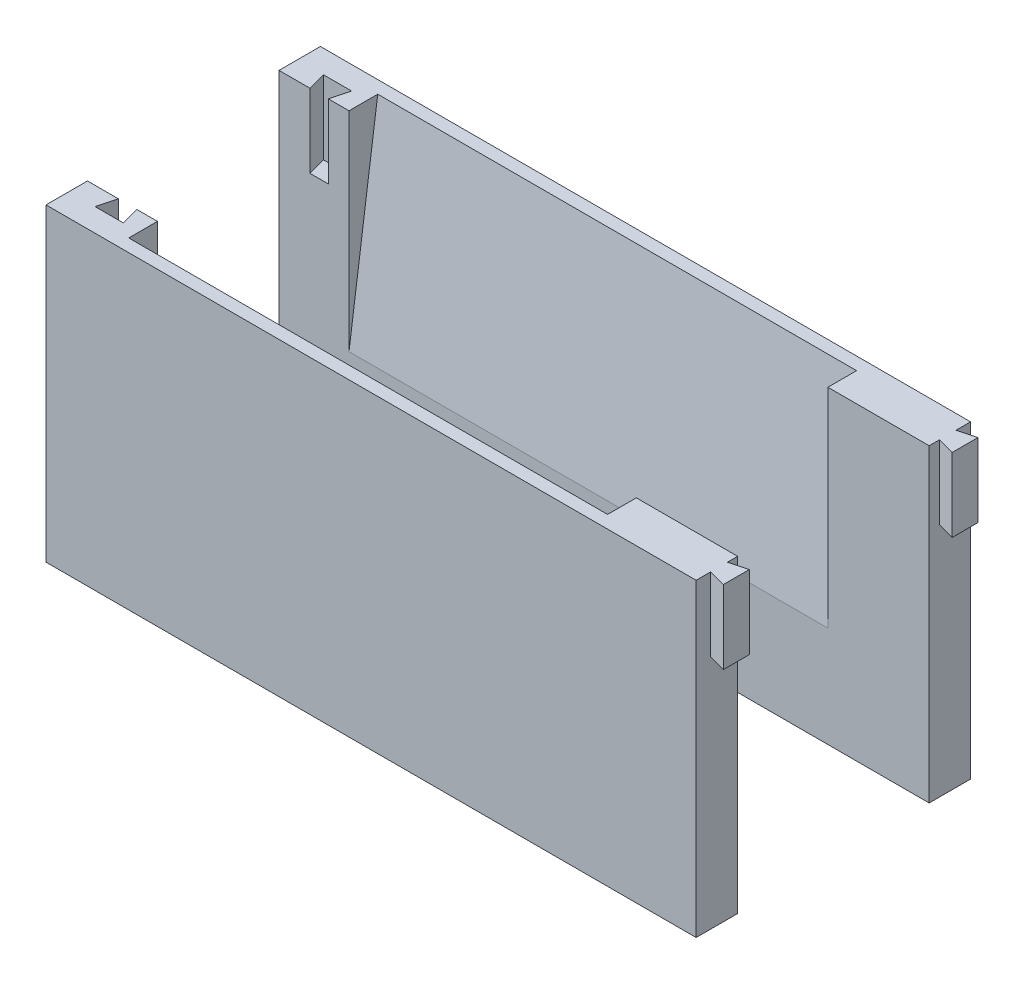
ISO-10303-21;
HEADER;
FILE_DESCRIPTION(('STEP AP214'),'2;1');
FILE_NAME('part.step','',(''),(''),'','','');
FILE_SCHEMA(('AUTOMOTIVE_DESIGN { 1 0 10303 214 1 1 1 1 }'));
ENDSEC;
DATA;
#1=APPLICATION_CONTEXT('core data for automotive mechanical design processes');
#2=APPLICATION_PROTOCOL_DEFINITION('international standard','automotive_design',2000,#1);
#3=PRODUCT_CONTEXT('',#1,'mechanical');
#4=PRODUCT('Part','Part','',(#3));
#5=PRODUCT_RELATED_PRODUCT_CATEGORY('part','',(#4));
#6=PRODUCT_DEFINITION_FORMATION('','',#4);
#7=PRODUCT_DEFINITION_CONTEXT('part definition',#1,'design');
#8=PRODUCT_DEFINITION('design','',#6,#7);
#9=PRODUCT_DEFINITION_SHAPE('','',#8);
#10=(LENGTH_UNIT() NAMED_UNIT(*) SI_UNIT(.MILLI.,.METRE.));
#11=(NAMED_UNIT(*) PLANE_ANGLE_UNIT() SI_UNIT($,.RADIAN.));
#12=(NAMED_UNIT(*) SI_UNIT($,.STERADIAN.) SOLID_ANGLE_UNIT());
#13=UNCERTAINTY_MEASURE_WITH_UNIT(LENGTH_MEASURE(1.E-05),#10,'distance_accuracy_value','');
#14=(GEOMETRIC_REPRESENTATION_CONTEXT(3) GLOBAL_UNCERTAINTY_ASSIGNED_CONTEXT((#13)) GLOBAL_UNIT_ASSIGNED_CONTEXT((#10,
#11,#12)) REPRESENTATION_CONTEXT('',''));
#15=CARTESIAN_POINT('',(0.,0.,0.));
#16=DIRECTION('',(0.,0.,1.));
#17=DIRECTION('',(1.,0.,0.));
#18=AXIS2_PLACEMENT_3D('',#15,#16,#17);
#19=CARTESIAN_POINT('',(46.2989745050857,14.0482922625164,-31.));
#20=DIRECTION('',(-1.,0.,0.));
#21=DIRECTION('',(0.,0.,-1.));
#22=AXIS2_PLACEMENT_3D('',#19,#20,#21);
#23=PLANE('',#22);
#24=DIRECTION('',(0.,1.,0.));
#25=VECTOR('',#24,1.);
#26=CARTESIAN_POINT('',(46.2989745050857,4.04829226251643,-27.4));
#27=LINE('',#26,#25);
#28=CARTESIAN_POINT('',(46.2989745050857,4.04829226251643,-27.4));
#29=VERTEX_POINT('',#28);
#30=CARTESIAN_POINT('',(46.2989745050857,14.0482922625164,-27.4));
#31=VERTEX_POINT('',#30);
#32=EDGE_CURVE('E227',#29,#31,#27,.T.);
#33=ORIENTED_EDGE('',*,*,#32,.T.);
#34=DIRECTION('',(0.,0.,1.));
#35=VECTOR('',#34,1.);
#36=CARTESIAN_POINT('',(46.2989745050857,14.0482922625164,-31.));
#37=LINE('',#36,#35);
#38=CARTESIAN_POINT('',(46.2989745050857,14.0482922625164,-26.));
#39=VERTEX_POINT('',#38);
#40=EDGE_CURVE('E172',#31,#39,#37,.T.);
#41=ORIENTED_EDGE('',*,*,#40,.T.);
#42=DIRECTION('',(0.,1.,0.));
#43=VECTOR('',#42,1.);
#44=CARTESIAN_POINT('',(46.2989745050857,14.0482922625164,-26.));
#45=LINE('',#44,#43);
#46=CARTESIAN_POINT('',(46.2989745050857,-27.9517077374836,-26.));
#47=VERTEX_POINT('',#46);
#48=EDGE_CURVE('E269',#47,#39,#45,.T.);
#49=ORIENTED_EDGE('',*,*,#48,.F.);
#50=DIRECTION('',(0.,0.,1.));
#51=VECTOR('',#50,1.);
#52=CARTESIAN_POINT('',(46.2989745050857,-27.9517077374836,-31.));
#53=LINE('',#52,#51);
#54=CARTESIAN_POINT('',(46.2989745050857,-27.9517077374836,-31.6203193977869));
#55=VERTEX_POINT('',#54);
#56=EDGE_CURVE('E63',#55,#47,#53,.T.);
#57=ORIENTED_EDGE('',*,*,#56,.F.);
#58=DIRECTION('',(0.,1.,0.));
#59=VECTOR('',#58,1.);
#60=CARTESIAN_POINT('',(46.2989745050857,-27.9517077374836,-31.6203193977869));
#61=LINE('',#60,#59);
#62=CARTESIAN_POINT('',(46.2989745050857,14.0482922625164,-31.6203193977869));
#63=VERTEX_POINT('',#62);
#64=EDGE_CURVE('E182',#55,#63,#61,.T.);
#65=ORIENTED_EDGE('',*,*,#64,.T.);
#66=CARTESIAN_POINT('',(46.2989745050857,14.0482922625164,-29.65));
#67=VERTEX_POINT('',#66);
#68=EDGE_CURVE('E186',#63,#67,#37,.T.);
#69=ORIENTED_EDGE('',*,*,#68,.T.);
#70=DIRECTION('',(0.,1.,0.));
#71=VECTOR('',#70,1.);
#72=CARTESIAN_POINT('',(46.2989745050857,4.04829226251643,-29.65));
#73=LINE('',#72,#71);
#74=CARTESIAN_POINT('',(46.2989745050857,4.04829226251643,-29.65));
#75=VERTEX_POINT('',#74);
#76=EDGE_CURVE('E221',#75,#67,#73,.T.);
#77=ORIENTED_EDGE('',*,*,#76,.F.);
#78=DIRECTION('',(0.,0.,-1.));
#79=VECTOR('',#78,1.);
#80=CARTESIAN_POINT('',(46.2989745050857,4.04829226251643,-27.4));
#81=LINE('',#80,#79);
#82=EDGE_CURVE('E211',#29,#75,#81,.T.);
#83=ORIENTED_EDGE('',*,*,#82,.F.);
#84=EDGE_LOOP('',(#33,#41,#49,#57,#65,#69,#77,#83));
#85=FACE_BOUND('',#84,.T.);
#86=ADVANCED_FACE('F55',(#85),#23,.F.);
#87=CARTESIAN_POINT('',(0.,0.,-26.));
#88=DIRECTION('',(0.,0.,-1.));
#89=DIRECTION('',(1.,0.,0.));
#90=AXIS2_PLACEMENT_3D('',#87,#88,#89);
#91=PLANE('',#90);
#92=DIRECTION('',(1.,0.,0.));
#93=VECTOR('',#92,1.);
#94=CARTESIAN_POINT('',(0.,-14.2665496728761,-26.));
#95=LINE('',#94,#93);
#96=CARTESIAN_POINT('',(-32.4510254949143,-14.2665496728761,-26.));
#97=VERTEX_POINT('',#96);
#98=CARTESIAN_POINT('',(32.5489745050857,-14.2665496728761,-26.));
#99=VERTEX_POINT('',#98);
#100=EDGE_CURVE('E208',#97,#99,#95,.T.);
#101=ORIENTED_EDGE('',*,*,#100,.F.);
#102=DIRECTION('',(0.,1.,0.));
#103=VECTOR('',#102,1.);
#104=CARTESIAN_POINT('',(-32.4510254949143,0.,-26.));
#105=LINE('',#104,#103);
#106=CARTESIAN_POINT('',(-32.4510254949143,14.0482922625164,-26.));
#107=VERTEX_POINT('',#106);
#108=EDGE_CURVE('E202',#97,#107,#105,.T.);
#109=ORIENTED_EDGE('',*,*,#108,.T.);
#110=DIRECTION('',(-1.,0.,0.));
#111=VECTOR('',#110,1.);
#112=CARTESIAN_POINT('',(-41.9510254949143,14.0482922625164,-26.));
#113=LINE('',#112,#111);
#114=CARTESIAN_POINT('',(-35.2510254949143,14.0482922625164,-26.));
#115=VERTEX_POINT('',#114);
#116=EDGE_CURVE('E274',#107,#115,#113,.T.);
#117=ORIENTED_EDGE('',*,*,#116,.T.);
#118=DIRECTION('',(0.,-1.,0.));
#119=VECTOR('',#118,1.);
#120=CARTESIAN_POINT('',(-35.2510254949143,188.876376348919,-26.));
#121=LINE('',#120,#119);
#122=CARTESIAN_POINT('',(-35.2510254949143,4.04829226251643,-26.));
#123=VERTEX_POINT('',#122);
#124=EDGE_CURVE('E258',#115,#123,#121,.T.);
#125=ORIENTED_EDGE('',*,*,#124,.T.);
#126=DIRECTION('',(-1.,0.,0.));
#127=VECTOR('',#126,1.);
#128=CARTESIAN_POINT('',(-41.9510254949143,4.04829226251643,-26.));
#129=LINE('',#128,#127);
#130=CARTESIAN_POINT('',(-37.7510254949143,4.04829226251643,-26.));
#131=VERTEX_POINT('',#130);
#132=EDGE_CURVE('E230',#123,#131,#129,.T.);
#133=ORIENTED_EDGE('',*,*,#132,.T.);
#134=DIRECTION('',(0.,-1.,0.));
#135=VECTOR('',#134,1.);
#136=CARTESIAN_POINT('',(-37.7510254949143,188.876376348919,-26.));
#137=LINE('',#136,#135);
#138=CARTESIAN_POINT('',(-37.7510254949143,14.0482922625164,-26.));
#139=VERTEX_POINT('',#138);
#140=EDGE_CURVE('E239',#139,#131,#137,.T.);
#141=ORIENTED_EDGE('',*,*,#140,.F.);
#142=CARTESIAN_POINT('',(-41.9510254949143,14.0482922625164,-26.));
#143=VERTEX_POINT('',#142);
#144=EDGE_CURVE('E272',#139,#143,#113,.T.);
#145=ORIENTED_EDGE('',*,*,#144,.T.);
#146=DIRECTION('',(0.,-1.,0.));
#147=VECTOR('',#146,1.);
#148=CARTESIAN_POINT('',(-41.9510254949143,14.0482922625164,-26.));
#149=LINE('',#148,#147);
#150=CARTESIAN_POINT('',(-41.9510254949143,-27.9517077374836,-26.));
#151=VERTEX_POINT('',#150);
#152=EDGE_CURVE('E168',#143,#151,#149,.T.);
#153=ORIENTED_EDGE('',*,*,#152,.T.);
#154=DIRECTION('',(1.,0.,0.));
#155=VECTOR('',#154,1.);
#156=CARTESIAN_POINT('',(-41.9510254949143,-27.9517077374836,-26.));
#157=LINE('',#156,#155);
#158=EDGE_CURVE('E267',#151,#47,#157,.T.);
#159=ORIENTED_EDGE('',*,*,#158,.T.);
#160=ORIENTED_EDGE('',*,*,#48,.T.);
#161=CARTESIAN_POINT('',(32.5489745050857,14.0482922625164,-26.));
#162=VERTEX_POINT('',#161);
#163=EDGE_CURVE('E173',#39,#162,#113,.T.);
#164=ORIENTED_EDGE('',*,*,#163,.T.);
#165=DIRECTION('',(0.,1.,0.));
#166=VECTOR('',#165,1.);
#167=CARTESIAN_POINT('',(32.5489745050857,0.,-26.));
#168=LINE('',#167,#166);
#169=EDGE_CURVE('E205',#99,#162,#168,.T.);
#170=ORIENTED_EDGE('',*,*,#169,.F.);
#171=EDGE_LOOP('',(#101,#109,#117,#125,#133,#141,#145,#153,#159,#160,#164,#170));
#172=FACE_BOUND('',#171,.T.);
#173=ADVANCED_FACE('F286',(#172),#91,.F.);
#174=CARTESIAN_POINT('',(-41.9510254949143,14.0482922625164,-31.));
#175=DIRECTION('',(1.,0.,0.));
#176=DIRECTION('',(0.,0.,1.));
#177=AXIS2_PLACEMENT_3D('',#174,#175,#176);
#178=PLANE('',#177);
#179=ORIENTED_EDGE('',*,*,#152,.F.);
#180=DIRECTION('',(0.,0.,1.));
#181=VECTOR('',#180,1.);
#182=CARTESIAN_POINT('',(-41.9510254949143,14.0482922625164,-31.));
#183=LINE('',#182,#181);
#184=CARTESIAN_POINT('',(-41.9510254949143,14.0482922625164,-31.6203193977869));
#185=VERTEX_POINT('',#184);
#186=EDGE_CURVE('E163',#185,#143,#183,.T.);
#187=ORIENTED_EDGE('',*,*,#186,.F.);
#188=DIRECTION('',(0.,1.,0.));
#189=VECTOR('',#188,1.);
#190=CARTESIAN_POINT('',(-41.9510254949143,-27.9517077374836,-31.6203193977869));
#191=LINE('',#190,#189);
#192=CARTESIAN_POINT('',(-41.9510254949143,-27.9517077374836,-31.6203193977869));
#193=VERTEX_POINT('',#192);
#194=EDGE_CURVE('E165',#193,#185,#191,.T.);
#195=ORIENTED_EDGE('',*,*,#194,.F.);
#196=DIRECTION('',(0.,0.,1.));
#197=VECTOR('',#196,1.);
#198=CARTESIAN_POINT('',(-41.9510254949143,-27.9517077374836,-31.));
#199=LINE('',#198,#197);
#200=EDGE_CURVE('E12',#193,#151,#199,.T.);
#201=ORIENTED_EDGE('',*,*,#200,.T.);
#202=EDGE_LOOP('',(#179,#187,#195,#201));
#203=FACE_BOUND('',#202,.T.);
#204=ADVANCED_FACE('F57',(#203),#178,.F.);
#205=CARTESIAN_POINT('',(-41.9510254949143,-27.9517077374836,-31.));
#206=DIRECTION('',(0.,1.,0.));
#207=DIRECTION('',(0.,0.,-1.));
#208=AXIS2_PLACEMENT_3D('',#205,#206,#207);
#209=PLANE('',#208);
#210=ORIENTED_EDGE('',*,*,#158,.F.);
#211=ORIENTED_EDGE('',*,*,#200,.F.);
#212=DIRECTION('',(-1.,0.,0.));
#213=VECTOR('',#212,1.);
#214=CARTESIAN_POINT('',(-41.9510254949143,-27.9517077374836,-31.6203193977869));
#215=LINE('',#214,#213);
#216=EDGE_CURVE('E181',#55,#193,#215,.T.);
#217=ORIENTED_EDGE('',*,*,#216,.F.);
#218=ORIENTED_EDGE('',*,*,#56,.T.);
#219=EDGE_LOOP('',(#210,#211,#217,#218));
#220=FACE_BOUND('',#219,.T.);
#221=ADVANCED_FACE('F280',(#220),#209,.F.);
#222=CARTESIAN_POINT('',(-41.9510254949143,14.0482922625164,-31.));
#223=DIRECTION('',(0.,-1.,0.));
#224=DIRECTION('',(0.,0.,1.));
#225=AXIS2_PLACEMENT_3D('',#222,#223,#224);
#226=PLANE('',#225);
#227=ORIENTED_EDGE('',*,*,#163,.F.);
#228=ORIENTED_EDGE('',*,*,#40,.F.);
#229=DIRECTION('',(-0.965925826289067,0.,-0.258819045102525));
#230=VECTOR('',#229,1.);
#231=CARTESIAN_POINT('',(48.6489745050857,14.0482922625164,-26.7703193977868));
#232=LINE('',#231,#230);
#233=CARTESIAN_POINT('',(48.6489745050857,14.0482922625164,-26.7703193977868));
#234=VERTEX_POINT('',#233);
#235=EDGE_CURVE('E215',#234,#31,#232,.T.);
#236=ORIENTED_EDGE('',*,*,#235,.F.);
#237=DIRECTION('',(0.,0.,1.));
#238=VECTOR('',#237,1.);
#239=CARTESIAN_POINT('',(48.6489745050857,14.0482922625164,-30.2796806022131));
#240=LINE('',#239,#238);
#241=CARTESIAN_POINT('',(48.6489745050857,14.0482922625164,-30.2796806022131));
#242=VERTEX_POINT('',#241);
#243=EDGE_CURVE('E223',#242,#234,#240,.T.);
#244=ORIENTED_EDGE('',*,*,#243,.F.);
#245=DIRECTION('',(0.965925826289067,0.,-0.258819045102525));
#246=VECTOR('',#245,1.);
#247=CARTESIAN_POINT('',(46.2989745050857,14.0482922625164,-29.65));
#248=LINE('',#247,#246);
#249=EDGE_CURVE('E78',#67,#242,#248,.T.);
#250=ORIENTED_EDGE('',*,*,#249,.F.);
#251=ORIENTED_EDGE('',*,*,#68,.F.);
#252=DIRECTION('',(-1.,0.,0.));
#253=VECTOR('',#252,1.);
#254=CARTESIAN_POINT('',(-41.9510254949143,14.0482922625164,-31.6203193977869));
#255=LINE('',#254,#253);
#256=EDGE_CURVE('E179',#63,#185,#255,.T.);
#257=ORIENTED_EDGE('',*,*,#256,.T.);
#258=ORIENTED_EDGE('',*,*,#186,.T.);
#259=ORIENTED_EDGE('',*,*,#144,.F.);
#260=DIRECTION('',(0.258819045102517,0.,0.965925826289069));
#261=VECTOR('',#260,1.);
#262=CARTESIAN_POINT('',(-37.7510254949143,14.0482922625164,-26.));
#263=LINE('',#262,#261);
#264=CARTESIAN_POINT('',(-38.4208984759921,14.0482922625164,-28.5));
#265=VERTEX_POINT('',#264);
#266=EDGE_CURVE('E243',#265,#139,#263,.T.);
#267=ORIENTED_EDGE('',*,*,#266,.F.);
#268=DIRECTION('',(-1.,0.,0.));
#269=VECTOR('',#268,1.);
#270=CARTESIAN_POINT('',(-38.4208984759921,14.0482922625164,-28.5));
#271=LINE('',#270,#269);
#272=CARTESIAN_POINT('',(-34.5811525138365,14.0482922625164,-28.5));
#273=VERTEX_POINT('',#272);
#274=EDGE_CURVE('E249',#273,#265,#271,.T.);
#275=ORIENTED_EDGE('',*,*,#274,.F.);
#276=DIRECTION('',(0.258819045102517,0.,-0.965925826289069));
#277=VECTOR('',#276,1.);
#278=CARTESIAN_POINT('',(-34.5811525138365,14.0482922625164,-28.5));
#279=LINE('',#278,#277);
#280=EDGE_CURVE('E246',#115,#273,#279,.T.);
#281=ORIENTED_EDGE('',*,*,#280,.F.);
#282=ORIENTED_EDGE('',*,*,#116,.F.);
#283=DIRECTION('',(0.,0.,1.));
#284=VECTOR('',#283,1.);
#285=CARTESIAN_POINT('',(-32.4510254949143,14.0482922625164,-26.));
#286=LINE('',#285,#284);
#287=CARTESIAN_POINT('',(-32.4510254949143,14.0482922625164,-29.9));
#288=VERTEX_POINT('',#287);
#289=EDGE_CURVE('E70',#288,#107,#286,.T.);
#290=ORIENTED_EDGE('',*,*,#289,.F.);
#291=DIRECTION('',(-1.,0.,0.));
#292=VECTOR('',#291,1.);
#293=CARTESIAN_POINT('',(32.5489745050857,14.0482922625164,-29.9));
#294=LINE('',#293,#292);
#295=CARTESIAN_POINT('',(32.5489745050857,14.0482922625164,-29.9));
#296=VERTEX_POINT('',#295);
#297=EDGE_CURVE('E197',#296,#288,#294,.T.);
#298=ORIENTED_EDGE('',*,*,#297,.F.);
#299=DIRECTION('',(0.,0.,1.));
#300=VECTOR('',#299,1.);
#301=CARTESIAN_POINT('',(32.5489745050857,14.0482922625164,-26.));
#302=LINE('',#301,#300);
#303=EDGE_CURVE('E196',#296,#162,#302,.T.);
#304=ORIENTED_EDGE('',*,*,#303,.T.);
#305=EDGE_LOOP('',(#227,#228,#236,#244,#250,#251,#257,#258,#259,#267,#275,#281,#282,#290,#298,#304));
#306=FACE_BOUND('',#305,.T.);
#307=ADVANCED_FACE('F184',(#306),#226,.F.);
#308=CARTESIAN_POINT('',(-34.5811525138365,188.876376348919,-28.5));
#309=DIRECTION('',(-0.965925826289069,0.,-0.258819045102517));
#310=DIRECTION('',(0.258819045102517,0.,-0.965925826289069));
#311=AXIS2_PLACEMENT_3D('',#308,#309,#310);
#312=PLANE('',#311);
#313=ORIENTED_EDGE('',*,*,#280,.T.);
#314=DIRECTION('',(0.,-1.,0.));
#315=VECTOR('',#314,1.);
#316=CARTESIAN_POINT('',(-34.5811525138365,188.876376348919,-28.5));
#317=LINE('',#316,#315);
#318=CARTESIAN_POINT('',(-34.5811525138365,4.04829226251643,-28.5));
#319=VERTEX_POINT('',#318);
#320=EDGE_CURVE('E261',#273,#319,#317,.T.);
#321=ORIENTED_EDGE('',*,*,#320,.T.);
#322=DIRECTION('',(0.258819045102517,0.,-0.965925826289069));
#323=VECTOR('',#322,1.);
#324=CARTESIAN_POINT('',(-34.5811525138365,4.04829226251643,-28.5));
#325=LINE('',#324,#323);
#326=EDGE_CURVE('E236',#123,#319,#325,.T.);
#327=ORIENTED_EDGE('',*,*,#326,.F.);
#328=ORIENTED_EDGE('',*,*,#124,.F.);
#329=EDGE_LOOP('',(#313,#321,#327,#328));
#330=FACE_BOUND('',#329,.T.);
#331=ADVANCED_FACE('F295',(#330),#312,.T.);
#332=CARTESIAN_POINT('',(-38.4208984759921,188.876376348919,-28.5));
#333=DIRECTION('',(0.,0.,1.));
#334=DIRECTION('',(-1.,0.,0.));
#335=AXIS2_PLACEMENT_3D('',#332,#333,#334);
#336=PLANE('',#335);
#337=ORIENTED_EDGE('',*,*,#274,.T.);
#338=DIRECTION('',(0.,-1.,0.));
#339=VECTOR('',#338,1.);
#340=CARTESIAN_POINT('',(-38.4208984759921,188.876376348919,-28.5));
#341=LINE('',#340,#339);
#342=CARTESIAN_POINT('',(-38.4208984759921,4.04829226251643,-28.5));
#343=VERTEX_POINT('',#342);
#344=EDGE_CURVE('E255',#265,#343,#341,.T.);
#345=ORIENTED_EDGE('',*,*,#344,.T.);
#346=DIRECTION('',(-1.,0.,0.));
#347=VECTOR('',#346,1.);
#348=CARTESIAN_POINT('',(-38.4208984759921,4.04829226251643,-28.5));
#349=LINE('',#348,#347);
#350=EDGE_CURVE('E240',#319,#343,#349,.T.);
#351=ORIENTED_EDGE('',*,*,#350,.F.);
#352=ORIENTED_EDGE('',*,*,#320,.F.);
#353=EDGE_LOOP('',(#337,#345,#351,#352));
#354=FACE_BOUND('',#353,.T.);
#355=ADVANCED_FACE('F302',(#354),#336,.T.);
#356=CARTESIAN_POINT('',(-37.7510254949143,188.876376348919,-26.));
#357=DIRECTION('',(0.965925826289069,0.,-0.258819045102517));
#358=DIRECTION('',(0.258819045102517,0.,0.965925826289069));
#359=AXIS2_PLACEMENT_3D('',#356,#357,#358);
#360=PLANE('',#359);
#361=ORIENTED_EDGE('',*,*,#266,.T.);
#362=ORIENTED_EDGE('',*,*,#140,.T.);
#363=DIRECTION('',(0.258819045102517,0.,0.965925826289069));
#364=VECTOR('',#363,1.);
#365=CARTESIAN_POINT('',(-37.7510254949143,4.04829226251643,-26.));
#366=LINE('',#365,#364);
#367=EDGE_CURVE('E241',#343,#131,#366,.T.);
#368=ORIENTED_EDGE('',*,*,#367,.F.);
#369=ORIENTED_EDGE('',*,*,#344,.F.);
#370=EDGE_LOOP('',(#361,#362,#368,#369));
#371=FACE_BOUND('',#370,.T.);
#372=ADVANCED_FACE('F300',(#371),#360,.T.);
#373=CARTESIAN_POINT('',(-41.9510254949143,4.04829226251643,-31.));
#374=DIRECTION('',(0.,-1.,0.));
#375=DIRECTION('',(0.,0.,1.));
#376=AXIS2_PLACEMENT_3D('',#373,#374,#375);
#377=PLANE('',#376);
#378=ORIENTED_EDGE('',*,*,#132,.F.);
#379=ORIENTED_EDGE('',*,*,#326,.T.);
#380=ORIENTED_EDGE('',*,*,#350,.T.);
#381=ORIENTED_EDGE('',*,*,#367,.T.);
#382=EDGE_LOOP('',(#378,#379,#380,#381));
#383=FACE_BOUND('',#382,.T.);
#384=ADVANCED_FACE('F298',(#383),#377,.F.);
#385=CARTESIAN_POINT('',(48.6489745050857,4.04829226251643,-26.7703193977868));
#386=DIRECTION('',(-0.258819045102525,0.,0.965925826289067));
#387=DIRECTION('',(-0.965925826289067,0.,-0.258819045102525));
#388=AXIS2_PLACEMENT_3D('',#385,#386,#387);
#389=PLANE('',#388);
#390=ORIENTED_EDGE('',*,*,#235,.T.);
#391=ORIENTED_EDGE('',*,*,#32,.F.);
#392=DIRECTION('',(-0.965925826289067,0.,-0.258819045102525));
#393=VECTOR('',#392,1.);
#394=CARTESIAN_POINT('',(48.6489745050857,4.04829226251643,-26.7703193977868));
#395=LINE('',#394,#393);
#396=CARTESIAN_POINT('',(48.6489745050857,4.04829226251643,-26.7703193977868));
#397=VERTEX_POINT('',#396);
#398=EDGE_CURVE('E219',#397,#29,#395,.T.);
#399=ORIENTED_EDGE('',*,*,#398,.F.);
#400=DIRECTION('',(0.,1.,0.));
#401=VECTOR('',#400,1.);
#402=CARTESIAN_POINT('',(48.6489745050857,4.04829226251643,-26.7703193977868));
#403=LINE('',#402,#401);
#404=EDGE_CURVE('E231',#397,#234,#403,.T.);
#405=ORIENTED_EDGE('',*,*,#404,.T.);
#406=EDGE_LOOP('',(#390,#391,#399,#405));
#407=FACE_BOUND('',#406,.T.);
#408=ADVANCED_FACE('F361',(#407),#389,.T.);
#409=CARTESIAN_POINT('',(48.6489745050857,4.04829226251643,-30.2796806022131));
#410=DIRECTION('',(1.,0.,0.));
#411=DIRECTION('',(0.,0.,1.));
#412=AXIS2_PLACEMENT_3D('',#409,#410,#411);
#413=PLANE('',#412);
#414=ORIENTED_EDGE('',*,*,#243,.T.);
#415=ORIENTED_EDGE('',*,*,#404,.F.);
#416=DIRECTION('',(0.,0.,1.));
#417=VECTOR('',#416,1.);
#418=CARTESIAN_POINT('',(48.6489745050857,4.04829226251643,-30.2796806022131));
#419=LINE('',#418,#417);
#420=CARTESIAN_POINT('',(48.6489745050857,4.04829226251643,-30.2796806022131));
#421=VERTEX_POINT('',#420);
#422=EDGE_CURVE('E217',#421,#397,#419,.T.);
#423=ORIENTED_EDGE('',*,*,#422,.F.);
#424=DIRECTION('',(0.,1.,0.));
#425=VECTOR('',#424,1.);
#426=CARTESIAN_POINT('',(48.6489745050857,4.04829226251643,-30.2796806022131));
#427=LINE('',#426,#425);
#428=EDGE_CURVE('E233',#421,#242,#427,.T.);
#429=ORIENTED_EDGE('',*,*,#428,.T.);
#430=EDGE_LOOP('',(#414,#415,#423,#429));
#431=FACE_BOUND('',#430,.T.);
#432=ADVANCED_FACE('F371',(#431),#413,.T.);
#433=CARTESIAN_POINT('',(46.2989745050857,4.04829226251643,-29.65));
#434=DIRECTION('',(-0.258819045102525,0.,-0.965925826289067));
#435=DIRECTION('',(0.965925826289067,0.,-0.258819045102525));
#436=AXIS2_PLACEMENT_3D('',#433,#434,#435);
#437=PLANE('',#436);
#438=ORIENTED_EDGE('',*,*,#249,.T.);
#439=ORIENTED_EDGE('',*,*,#428,.F.);
#440=DIRECTION('',(0.965925826289067,0.,-0.258819045102525));
#441=VECTOR('',#440,1.);
#442=CARTESIAN_POINT('',(46.2989745050857,4.04829226251643,-29.65));
#443=LINE('',#442,#441);
#444=EDGE_CURVE('E214',#75,#421,#443,.T.);
#445=ORIENTED_EDGE('',*,*,#444,.F.);
#446=ORIENTED_EDGE('',*,*,#76,.T.);
#447=EDGE_LOOP('',(#438,#439,#445,#446));
#448=FACE_BOUND('',#447,.T.);
#449=ADVANCED_FACE('F382',(#448),#437,.T.);
#450=CARTESIAN_POINT('',(0.,4.04829226251643,-26.));
#451=DIRECTION('',(0.,1.,0.));
#452=DIRECTION('',(0.,0.,-1.));
#453=AXIS2_PLACEMENT_3D('',#450,#451,#452);
#454=PLANE('',#453);
#455=ORIENTED_EDGE('',*,*,#82,.T.);
#456=ORIENTED_EDGE('',*,*,#444,.T.);
#457=ORIENTED_EDGE('',*,*,#422,.T.);
#458=ORIENTED_EDGE('',*,*,#398,.T.);
#459=EDGE_LOOP('',(#455,#456,#457,#458));
#460=FACE_BOUND('',#459,.T.);
#461=ADVANCED_FACE('F393',(#460),#454,.F.);
#462=CARTESIAN_POINT('',(32.5489745050857,-14.6295604669197,-25.95));
#463=DIRECTION('',(0.,-0.136448716147365,-0.990647135897407));
#464=DIRECTION('',(0.,-0.990647135897407,0.136448716147365));
#465=AXIS2_PLACEMENT_3D('',#462,#463,#464);
#466=PLANE('',#465);
#467=DIRECTION('',(0.,0.990647135897407,-0.136448716147365));
#468=VECTOR('',#467,1.);
#469=CARTESIAN_POINT('',(-32.4510254949143,-14.6295604669197,-25.95));
#470=LINE('',#469,#468);
#471=EDGE_CURVE('E188',#97,#288,#470,.T.);
#472=ORIENTED_EDGE('',*,*,#471,.F.);
#473=ORIENTED_EDGE('',*,*,#100,.T.);
#474=DIRECTION('',(0.,0.990647135897407,-0.136448716147365));
#475=VECTOR('',#474,1.);
#476=CARTESIAN_POINT('',(32.5489745050857,-14.6295604669197,-25.95));
#477=LINE('',#476,#475);
#478=EDGE_CURVE('E194',#99,#296,#477,.T.);
#479=ORIENTED_EDGE('',*,*,#478,.T.);
#480=ORIENTED_EDGE('',*,*,#297,.T.);
#481=EDGE_LOOP('',(#472,#473,#479,#480));
#482=FACE_BOUND('',#481,.T.);
#483=ADVANCED_FACE('F404',(#482),#466,.F.);
#484=CARTESIAN_POINT('',(32.5489745050857,0.,-26.));
#485=DIRECTION('',(1.,0.,0.));
#486=DIRECTION('',(0.,0.,1.));
#487=AXIS2_PLACEMENT_3D('',#484,#485,#486);
#488=PLANE('',#487);
#489=ORIENTED_EDGE('',*,*,#478,.F.);
#490=ORIENTED_EDGE('',*,*,#169,.T.);
#491=ORIENTED_EDGE('',*,*,#303,.F.);
#492=EDGE_LOOP('',(#489,#490,#491));
#493=FACE_BOUND('',#492,.T.);
#494=ADVANCED_FACE('F415',(#493),#488,.F.);
#495=CARTESIAN_POINT('',(-32.4510254949143,0.,-26.));
#496=DIRECTION('',(1.,0.,0.));
#497=DIRECTION('',(0.,0.,1.));
#498=AXIS2_PLACEMENT_3D('',#495,#496,#497);
#499=PLANE('',#498);
#500=ORIENTED_EDGE('',*,*,#108,.F.);
#501=ORIENTED_EDGE('',*,*,#471,.T.);
#502=ORIENTED_EDGE('',*,*,#289,.T.);
#503=EDGE_LOOP('',(#500,#501,#502));
#504=FACE_BOUND('',#503,.T.);
#505=ADVANCED_FACE('F426',(#504),#499,.T.);
#506=CARTESIAN_POINT('',(-41.9510254949143,-27.9517077374836,-31.6203193977869));
#507=DIRECTION('',(0.,0.,-1.));
#508=DIRECTION('',(-1.,0.,0.));
#509=AXIS2_PLACEMENT_3D('',#506,#507,#508);
#510=PLANE('',#509);
#511=ORIENTED_EDGE('',*,*,#256,.F.);
#512=ORIENTED_EDGE('',*,*,#64,.F.);
#513=ORIENTED_EDGE('',*,*,#216,.T.);
#514=ORIENTED_EDGE('',*,*,#194,.T.);
#515=EDGE_LOOP('',(#511,#512,#513,#514));
#516=FACE_BOUND('',#515,.T.);
#517=ADVANCED_FACE('F177',(#516),#510,.T.);
#518=CLOSED_SHELL('',(#86,#173,#204,#221,#307,#331,#355,#372,#384,#408,#432,#449,#461,#483,#494,
#505,#517));
#519=MANIFOLD_SOLID_BREP('B2',#518);
#520=CARTESIAN_POINT('',(46.2989745050857,14.0482922625164,5.));
#521=DIRECTION('',(-1.,0.,0.));
#522=DIRECTION('',(0.,0.,1.));
#523=AXIS2_PLACEMENT_3D('',#520,#521,#522);
#524=PLANE('',#523);
#525=DIRECTION('',(0.,1.,0.));
#526=VECTOR('',#525,1.);
#527=CARTESIAN_POINT('',(46.2989745050857,4.04829226251643,1.4));
#528=LINE('',#527,#526);
#529=CARTESIAN_POINT('',(46.2989745050857,4.04829226251643,1.4));
#530=VERTEX_POINT('',#529);
#531=CARTESIAN_POINT('',(46.2989745050857,14.0482922625164,1.4));
#532=VERTEX_POINT('',#531);
#533=EDGE_CURVE('E702',#530,#532,#528,.T.);
#534=ORIENTED_EDGE('',*,*,#533,.F.);
#535=DIRECTION('',(0.,0.,1.));
#536=VECTOR('',#535,1.);
#537=CARTESIAN_POINT('',(46.2989745050857,4.04829226251643,1.4));
#538=LINE('',#537,#536);
#539=CARTESIAN_POINT('',(46.2989745050857,4.04829226251643,3.65));
#540=VERTEX_POINT('',#539);
#541=EDGE_CURVE('E675',#530,#540,#538,.T.);
#542=ORIENTED_EDGE('',*,*,#541,.T.);
#543=DIRECTION('',(0.,1.,0.));
#544=VECTOR('',#543,1.);
#545=CARTESIAN_POINT('',(46.2989745050857,4.04829226251643,3.65));
#546=LINE('',#545,#544);
#547=CARTESIAN_POINT('',(46.2989745050857,14.0482922625164,3.65));
#548=VERTEX_POINT('',#547);
#549=EDGE_CURVE('E692',#540,#548,#546,.T.);
#550=ORIENTED_EDGE('',*,*,#549,.T.);
#551=DIRECTION('',(0.,0.,-1.));
#552=VECTOR('',#551,1.);
#553=CARTESIAN_POINT('',(46.2989745050857,14.0482922625164,5.));
#554=LINE('',#553,#552);
#555=CARTESIAN_POINT('',(46.2989745050857,14.0482922625164,5.63));
#556=VERTEX_POINT('',#555);
#557=EDGE_CURVE('E774',#556,#548,#554,.T.);
#558=ORIENTED_EDGE('',*,*,#557,.F.);
#559=DIRECTION('',(0.,1.,0.));
#560=VECTOR('',#559,1.);
#561=CARTESIAN_POINT('',(46.2989745050857,-27.9517077374836,5.63));
#562=LINE('',#561,#560);
#563=CARTESIAN_POINT('',(46.2989745050857,-27.9517077374836,5.63));
#564=VERTEX_POINT('',#563);
#565=EDGE_CURVE('E637',#564,#556,#562,.T.);
#566=ORIENTED_EDGE('',*,*,#565,.F.);
#567=DIRECTION('',(0.,0.,-1.));
#568=VECTOR('',#567,1.);
#569=CARTESIAN_POINT('',(46.2989745050857,-27.9517077374836,5.));
#570=LINE('',#569,#568);
#571=CARTESIAN_POINT('',(46.2989745050857,-27.9517077374836,0.));
#572=VERTEX_POINT('',#571);
#573=EDGE_CURVE('E520',#564,#572,#570,.T.);
#574=ORIENTED_EDGE('',*,*,#573,.T.);
#575=DIRECTION('',(0.,1.,0.));
#576=VECTOR('',#575,1.);
#577=CARTESIAN_POINT('',(46.2989745050857,14.0482922625164,0.));
#578=LINE('',#577,#576);
#579=CARTESIAN_POINT('',(46.2989745050857,14.0482922625164,0.));
#580=VERTEX_POINT('',#579);
#581=EDGE_CURVE('E760',#572,#580,#578,.T.);
#582=ORIENTED_EDGE('',*,*,#581,.T.);
#583=EDGE_CURVE('E773',#532,#580,#554,.T.);
#584=ORIENTED_EDGE('',*,*,#583,.F.);
#585=EDGE_LOOP('',(#534,#542,#550,#558,#566,#574,#582,#584));
#586=FACE_BOUND('',#585,.T.);
#587=ADVANCED_FACE('F511',(#586),#524,.F.);
#588=CARTESIAN_POINT('',(0.,0.,0.));
#589=DIRECTION('',(0.,0.,1.));
#590=DIRECTION('',(1.,0.,0.));
#591=AXIS2_PLACEMENT_3D('',#588,#589,#590);
#592=PLANE('',#591);
#593=DIRECTION('',(1.,0.,0.));
#594=VECTOR('',#593,1.);
#595=CARTESIAN_POINT('',(0.,-14.2665496728761,0.));
#596=LINE('',#595,#594);
#597=CARTESIAN_POINT('',(-32.4510254949143,-14.2665496728761,0.));
#598=VERTEX_POINT('',#597);
#599=CARTESIAN_POINT('',(32.5489745050857,-14.2665496728761,0.));
#600=VERTEX_POINT('',#599);
#601=EDGE_CURVE('E671',#598,#600,#596,.T.);
#602=ORIENTED_EDGE('',*,*,#601,.T.);
#603=DIRECTION('',(0.,1.,0.));
#604=VECTOR('',#603,1.);
#605=CARTESIAN_POINT('',(32.5489745050857,0.,0.));
#606=LINE('',#605,#604);
#607=CARTESIAN_POINT('',(32.5489745050857,14.0482922625164,0.));
#608=VERTEX_POINT('',#607);
#609=EDGE_CURVE('E667',#600,#608,#606,.T.);
#610=ORIENTED_EDGE('',*,*,#609,.T.);
#611=DIRECTION('',(-1.,0.,0.));
#612=VECTOR('',#611,1.);
#613=CARTESIAN_POINT('',(-41.9510254949143,14.0482922625164,0.));
#614=LINE('',#613,#612);
#615=EDGE_CURVE('E765',#580,#608,#614,.T.);
#616=ORIENTED_EDGE('',*,*,#615,.F.);
#617=ORIENTED_EDGE('',*,*,#581,.F.);
#618=DIRECTION('',(1.,0.,0.));
#619=VECTOR('',#618,1.);
#620=CARTESIAN_POINT('',(-41.9510254949143,-27.9517077374836,0.));
#621=LINE('',#620,#619);
#622=CARTESIAN_POINT('',(-41.9510254949143,-27.9517077374836,0.));
#623=VERTEX_POINT('',#622);
#624=EDGE_CURVE('E757',#623,#572,#621,.T.);
#625=ORIENTED_EDGE('',*,*,#624,.F.);
#626=DIRECTION('',(0.,-1.,0.));
#627=VECTOR('',#626,1.);
#628=CARTESIAN_POINT('',(-41.9510254949143,14.0482922625164,0.));
#629=LINE('',#628,#627);
#630=CARTESIAN_POINT('',(-41.9510254949143,14.0482922625164,0.));
#631=VERTEX_POINT('',#630);
#632=EDGE_CURVE('E626',#631,#623,#629,.T.);
#633=ORIENTED_EDGE('',*,*,#632,.F.);
#634=CARTESIAN_POINT('',(-37.7510254949143,14.0482922625164,0.));
#635=VERTEX_POINT('',#634);
#636=EDGE_CURVE('E764',#635,#631,#614,.T.);
#637=ORIENTED_EDGE('',*,*,#636,.F.);
#638=DIRECTION('',(0.,-1.,0.));
#639=VECTOR('',#638,1.);
#640=CARTESIAN_POINT('',(-37.7510254949143,188.876376348919,0.));
#641=LINE('',#640,#639);
#642=CARTESIAN_POINT('',(-37.7510254949143,4.04829226251643,0.));
#643=VERTEX_POINT('',#642);
#644=EDGE_CURVE('E718',#635,#643,#641,.T.);
#645=ORIENTED_EDGE('',*,*,#644,.T.);
#646=DIRECTION('',(-1.,0.,0.));
#647=VECTOR('',#646,1.);
#648=CARTESIAN_POINT('',(-41.9510254949143,4.04829226251643,0.));
#649=LINE('',#648,#647);
#650=CARTESIAN_POINT('',(-35.2510254949143,4.04829226251643,0.));
#651=VERTEX_POINT('',#650);
#652=EDGE_CURVE('E705',#651,#643,#649,.T.);
#653=ORIENTED_EDGE('',*,*,#652,.F.);
#654=DIRECTION('',(0.,-1.,0.));
#655=VECTOR('',#654,1.);
#656=CARTESIAN_POINT('',(-35.2510254949143,188.876376348919,0.));
#657=LINE('',#656,#655);
#658=CARTESIAN_POINT('',(-35.2510254949143,14.0482922625164,0.));
#659=VERTEX_POINT('',#658);
#660=EDGE_CURVE('E746',#659,#651,#657,.T.);
#661=ORIENTED_EDGE('',*,*,#660,.F.);
#662=CARTESIAN_POINT('',(-32.4510254949143,14.0482922625164,0.));
#663=VERTEX_POINT('',#662);
#664=EDGE_CURVE('E770',#663,#659,#614,.T.);
#665=ORIENTED_EDGE('',*,*,#664,.F.);
#666=DIRECTION('',(0.,1.,0.));
#667=VECTOR('',#666,1.);
#668=CARTESIAN_POINT('',(-32.4510254949143,0.,0.));
#669=LINE('',#668,#667);
#670=EDGE_CURVE('E527',#598,#663,#669,.T.);
#671=ORIENTED_EDGE('',*,*,#670,.F.);
#672=EDGE_LOOP('',(#602,#610,#616,#617,#625,#633,#637,#645,#653,#661,#665,#671));
#673=FACE_BOUND('',#672,.T.);
#674=ADVANCED_FACE('F784',(#673),#592,.F.);
#675=CARTESIAN_POINT('',(-41.9510254949143,14.0482922625164,5.));
#676=DIRECTION('',(1.,0.,0.));
#677=DIRECTION('',(0.,0.,-1.));
#678=AXIS2_PLACEMENT_3D('',#675,#676,#677);
#679=PLANE('',#678);
#680=ORIENTED_EDGE('',*,*,#632,.T.);
#681=DIRECTION('',(0.,0.,-1.));
#682=VECTOR('',#681,1.);
#683=CARTESIAN_POINT('',(-41.9510254949143,-27.9517077374836,5.));
#684=LINE('',#683,#682);
#685=CARTESIAN_POINT('',(-41.9510254949143,-27.9517077374836,5.63));
#686=VERTEX_POINT('',#685);
#687=EDGE_CURVE('E53',#686,#623,#684,.T.);
#688=ORIENTED_EDGE('',*,*,#687,.F.);
#689=DIRECTION('',(0.,1.,0.));
#690=VECTOR('',#689,1.);
#691=CARTESIAN_POINT('',(-41.9510254949143,-27.9517077374836,5.63));
#692=LINE('',#691,#690);
#693=CARTESIAN_POINT('',(-41.9510254949143,14.0482922625164,5.63));
#694=VERTEX_POINT('',#693);
#695=EDGE_CURVE('E623',#686,#694,#692,.T.);
#696=ORIENTED_EDGE('',*,*,#695,.T.);
#697=DIRECTION('',(0.,0.,-1.));
#698=VECTOR('',#697,1.);
#699=CARTESIAN_POINT('',(-41.9510254949143,14.0482922625164,5.));
#700=LINE('',#699,#698);
#701=EDGE_CURVE('E769',#694,#631,#700,.T.);
#702=ORIENTED_EDGE('',*,*,#701,.T.);
#703=EDGE_LOOP('',(#680,#688,#696,#702));
#704=FACE_BOUND('',#703,.T.);
#705=ADVANCED_FACE('F513',(#704),#679,.F.);
#706=CARTESIAN_POINT('',(-41.9510254949143,-27.9517077374836,5.));
#707=DIRECTION('',(0.,1.,0.));
#708=DIRECTION('',(0.,0.,1.));
#709=AXIS2_PLACEMENT_3D('',#706,#707,#708);
#710=PLANE('',#709);
#711=ORIENTED_EDGE('',*,*,#624,.T.);
#712=ORIENTED_EDGE('',*,*,#573,.F.);
#713=DIRECTION('',(1.,0.,0.));
#714=VECTOR('',#713,1.);
#715=CARTESIAN_POINT('',(-41.9510254949143,-27.9517077374836,5.63));
#716=LINE('',#715,#714);
#717=EDGE_CURVE('E633',#686,#564,#716,.T.);
#718=ORIENTED_EDGE('',*,*,#717,.F.);
#719=ORIENTED_EDGE('',*,*,#687,.T.);
#720=EDGE_LOOP('',(#711,#712,#718,#719));
#721=FACE_BOUND('',#720,.T.);
#722=ADVANCED_FACE('F639',(#721),#710,.F.);
#723=CARTESIAN_POINT('',(-41.9510254949143,14.0482922625164,5.));
#724=DIRECTION('',(0.,-1.,0.));
#725=DIRECTION('',(0.,0.,-1.));
#726=AXIS2_PLACEMENT_3D('',#723,#724,#725);
#727=PLANE('',#726);
#728=ORIENTED_EDGE('',*,*,#615,.T.);
#729=DIRECTION('',(0.,0.,-1.));
#730=VECTOR('',#729,1.);
#731=CARTESIAN_POINT('',(32.5489745050857,14.0482922625164,0.));
#732=LINE('',#731,#730);
#733=CARTESIAN_POINT('',(32.5489745050857,14.0482922625164,3.9));
#734=VERTEX_POINT('',#733);
#735=EDGE_CURVE('E653',#734,#608,#732,.T.);
#736=ORIENTED_EDGE('',*,*,#735,.F.);
#737=DIRECTION('',(-1.,0.,0.));
#738=VECTOR('',#737,1.);
#739=CARTESIAN_POINT('',(32.5489745050857,14.0482922625164,3.9));
#740=LINE('',#739,#738);
#741=CARTESIAN_POINT('',(-32.4510254949143,14.0482922625164,3.9));
#742=VERTEX_POINT('',#741);
#743=EDGE_CURVE('E657',#734,#742,#740,.T.);
#744=ORIENTED_EDGE('',*,*,#743,.T.);
#745=DIRECTION('',(0.,0.,-1.));
#746=VECTOR('',#745,1.);
#747=CARTESIAN_POINT('',(-32.4510254949143,14.0482922625164,0.));
#748=LINE('',#747,#746);
#749=EDGE_CURVE('E654',#742,#663,#748,.T.);
#750=ORIENTED_EDGE('',*,*,#749,.T.);
#751=ORIENTED_EDGE('',*,*,#664,.T.);
#752=DIRECTION('',(0.258819045102517,0.,0.965925826289069));
#753=VECTOR('',#752,1.);
#754=CARTESIAN_POINT('',(-34.5811525138365,14.0482922625164,2.5));
#755=LINE('',#754,#753);
#756=CARTESIAN_POINT('',(-34.5811525138365,14.0482922625164,2.5));
#757=VERTEX_POINT('',#756);
#758=EDGE_CURVE('E728',#659,#757,#755,.T.);
#759=ORIENTED_EDGE('',*,*,#758,.T.);
#760=DIRECTION('',(-1.,0.,0.));
#761=VECTOR('',#760,1.);
#762=CARTESIAN_POINT('',(-38.4208984759921,14.0482922625164,2.5));
#763=LINE('',#762,#761);
#764=CARTESIAN_POINT('',(-38.4208984759921,14.0482922625164,2.5));
#765=VERTEX_POINT('',#764);
#766=EDGE_CURVE('E732',#757,#765,#763,.T.);
#767=ORIENTED_EDGE('',*,*,#766,.T.);
#768=DIRECTION('',(0.258819045102517,0.,-0.965925826289069));
#769=VECTOR('',#768,1.);
#770=CARTESIAN_POINT('',(-37.7510254949143,14.0482922625164,0.));
#771=LINE('',#770,#769);
#772=EDGE_CURVE('E724',#765,#635,#771,.T.);
#773=ORIENTED_EDGE('',*,*,#772,.T.);
#774=ORIENTED_EDGE('',*,*,#636,.T.);
#775=ORIENTED_EDGE('',*,*,#701,.F.);
#776=DIRECTION('',(1.,0.,0.));
#777=VECTOR('',#776,1.);
#778=CARTESIAN_POINT('',(-41.9510254949143,14.0482922625164,5.63));
#779=LINE('',#778,#777);
#780=EDGE_CURVE('E635',#694,#556,#779,.T.);
#781=ORIENTED_EDGE('',*,*,#780,.T.);
#782=ORIENTED_EDGE('',*,*,#557,.T.);
#783=DIRECTION('',(0.965925826289067,0.,0.258819045102525));
#784=VECTOR('',#783,1.);
#785=CARTESIAN_POINT('',(46.2989745050857,14.0482922625164,3.65));
#786=LINE('',#785,#784);
#787=CARTESIAN_POINT('',(48.6489745050857,14.0482922625164,4.27968060221315));
#788=VERTEX_POINT('',#787);
#789=EDGE_CURVE('E535',#548,#788,#786,.T.);
#790=ORIENTED_EDGE('',*,*,#789,.T.);
#791=DIRECTION('',(0.,0.,-1.));
#792=VECTOR('',#791,1.);
#793=CARTESIAN_POINT('',(48.6489745050857,14.0482922625164,4.27968060221315));
#794=LINE('',#793,#792);
#795=CARTESIAN_POINT('',(48.6489745050857,14.0482922625164,0.770319397786852));
#796=VERTEX_POINT('',#795);
#797=EDGE_CURVE('E695',#788,#796,#794,.T.);
#798=ORIENTED_EDGE('',*,*,#797,.T.);
#799=DIRECTION('',(-0.965925826289067,0.,0.258819045102525));
#800=VECTOR('',#799,1.);
#801=CARTESIAN_POINT('',(48.6489745050857,14.0482922625164,0.770319397786852));
#802=LINE('',#801,#800);
#803=EDGE_CURVE('E680',#796,#532,#802,.T.);
#804=ORIENTED_EDGE('',*,*,#803,.T.);
#805=ORIENTED_EDGE('',*,*,#583,.T.);
#806=EDGE_LOOP('',(#728,#736,#744,#750,#751,#759,#767,#773,#774,#775,#781,#782,#790,#798,#804,#805));
#807=FACE_BOUND('',#806,.T.);
#808=ADVANCED_FACE('F787',(#807),#727,.F.);
#809=CARTESIAN_POINT('',(-34.5811525138365,188.876376348919,2.5));
#810=DIRECTION('',(-0.965925826289069,0.,0.258819045102517));
#811=DIRECTION('',(0.258819045102517,0.,0.965925826289069));
#812=AXIS2_PLACEMENT_3D('',#809,#810,#811);
#813=PLANE('',#812);
#814=ORIENTED_EDGE('',*,*,#758,.F.);
#815=ORIENTED_EDGE('',*,*,#660,.T.);
#816=DIRECTION('',(0.258819045102517,0.,0.965925826289069));
#817=VECTOR('',#816,1.);
#818=CARTESIAN_POINT('',(-34.5811525138365,4.04829226251643,2.5));
#819=LINE('',#818,#817);
#820=CARTESIAN_POINT('',(-34.5811525138365,4.04829226251643,2.5));
#821=VERTEX_POINT('',#820);
#822=EDGE_CURVE('E714',#651,#821,#819,.T.);
#823=ORIENTED_EDGE('',*,*,#822,.T.);
#824=DIRECTION('',(0.,-1.,0.));
#825=VECTOR('',#824,1.);
#826=CARTESIAN_POINT('',(-34.5811525138365,188.876376348919,2.5));
#827=LINE('',#826,#825);
#828=EDGE_CURVE('E749',#757,#821,#827,.T.);
#829=ORIENTED_EDGE('',*,*,#828,.F.);
#830=EDGE_LOOP('',(#814,#815,#823,#829));
#831=FACE_BOUND('',#830,.T.);
#832=ADVANCED_FACE('F806',(#831),#813,.T.);
#833=CARTESIAN_POINT('',(-38.4208984759921,188.876376348919,2.5));
#834=DIRECTION('',(0.,0.,-1.));
#835=DIRECTION('',(-1.,0.,0.));
#836=AXIS2_PLACEMENT_3D('',#833,#834,#835);
#837=PLANE('',#836);
#838=ORIENTED_EDGE('',*,*,#766,.F.);
#839=ORIENTED_EDGE('',*,*,#828,.T.);
#840=DIRECTION('',(-1.,0.,0.));
#841=VECTOR('',#840,1.);
#842=CARTESIAN_POINT('',(-38.4208984759921,4.04829226251643,2.5));
#843=LINE('',#842,#841);
#844=CARTESIAN_POINT('',(-38.4208984759921,4.04829226251643,2.5));
#845=VERTEX_POINT('',#844);
#846=EDGE_CURVE('E719',#821,#845,#843,.T.);
#847=ORIENTED_EDGE('',*,*,#846,.T.);
#848=DIRECTION('',(0.,-1.,0.));
#849=VECTOR('',#848,1.);
#850=CARTESIAN_POINT('',(-38.4208984759921,188.876376348919,2.5));
#851=LINE('',#850,#849);
#852=EDGE_CURVE('E742',#765,#845,#851,.T.);
#853=ORIENTED_EDGE('',*,*,#852,.F.);
#854=EDGE_LOOP('',(#838,#839,#847,#853));
#855=FACE_BOUND('',#854,.T.);
#856=ADVANCED_FACE('F802',(#855),#837,.T.);
#857=CARTESIAN_POINT('',(-37.7510254949143,188.876376348919,0.));
#858=DIRECTION('',(0.965925826289069,0.,0.258819045102517));
#859=DIRECTION('',(0.258819045102517,0.,-0.965925826289069));
#860=AXIS2_PLACEMENT_3D('',#857,#858,#859);
#861=PLANE('',#860);
#862=ORIENTED_EDGE('',*,*,#772,.F.);
#863=ORIENTED_EDGE('',*,*,#852,.T.);
#864=DIRECTION('',(0.258819045102517,0.,-0.965925826289069));
#865=VECTOR('',#864,1.);
#866=CARTESIAN_POINT('',(-37.7510254949143,4.04829226251643,0.));
#867=LINE('',#866,#865);
#868=EDGE_CURVE('E720',#845,#643,#867,.T.);
#869=ORIENTED_EDGE('',*,*,#868,.T.);
#870=ORIENTED_EDGE('',*,*,#644,.F.);
#871=EDGE_LOOP('',(#862,#863,#869,#870));
#872=FACE_BOUND('',#871,.T.);
#873=ADVANCED_FACE('F796',(#872),#861,.T.);
#874=CARTESIAN_POINT('',(-41.9510254949143,4.04829226251643,5.));
#875=DIRECTION('',(0.,-1.,0.));
#876=DIRECTION('',(0.,0.,-1.));
#877=AXIS2_PLACEMENT_3D('',#874,#875,#876);
#878=PLANE('',#877);
#879=ORIENTED_EDGE('',*,*,#652,.T.);
#880=ORIENTED_EDGE('',*,*,#868,.F.);
#881=ORIENTED_EDGE('',*,*,#846,.F.);
#882=ORIENTED_EDGE('',*,*,#822,.F.);
#883=EDGE_LOOP('',(#879,#880,#881,#882));
#884=FACE_BOUND('',#883,.T.);
#885=ADVANCED_FACE('F799',(#884),#878,.F.);
#886=CARTESIAN_POINT('',(48.6489745050857,4.04829226251643,0.770319397786852));
#887=DIRECTION('',(-0.258819045102525,0.,-0.965925826289067));
#888=DIRECTION('',(-0.965925826289067,0.,0.258819045102525));
#889=AXIS2_PLACEMENT_3D('',#886,#887,#888);
#890=PLANE('',#889);
#891=ORIENTED_EDGE('',*,*,#803,.F.);
#892=DIRECTION('',(0.,1.,0.));
#893=VECTOR('',#892,1.);
#894=CARTESIAN_POINT('',(48.6489745050857,4.04829226251643,0.770319397786852));
#895=LINE('',#894,#893);
#896=CARTESIAN_POINT('',(48.6489745050857,4.04829226251643,0.770319397786852));
#897=VERTEX_POINT('',#896);
#898=EDGE_CURVE('E706',#897,#796,#895,.T.);
#899=ORIENTED_EDGE('',*,*,#898,.F.);
#900=DIRECTION('',(-0.965925826289067,0.,0.258819045102525));
#901=VECTOR('',#900,1.);
#902=CARTESIAN_POINT('',(48.6489745050857,4.04829226251643,0.770319397786852));
#903=LINE('',#902,#901);
#904=EDGE_CURVE('E688',#897,#530,#903,.T.);
#905=ORIENTED_EDGE('',*,*,#904,.T.);
#906=ORIENTED_EDGE('',*,*,#533,.T.);
#907=EDGE_LOOP('',(#891,#899,#905,#906));
#908=FACE_BOUND('',#907,.T.);
#909=ADVANCED_FACE('F937',(#908),#890,.T.);
#910=CARTESIAN_POINT('',(48.6489745050857,4.04829226251643,4.27968060221315));
#911=DIRECTION('',(1.,0.,0.));
#912=DIRECTION('',(0.,0.,-1.));
#913=AXIS2_PLACEMENT_3D('',#910,#911,#912);
#914=PLANE('',#913);
#915=ORIENTED_EDGE('',*,*,#797,.F.);
#916=DIRECTION('',(0.,1.,0.));
#917=VECTOR('',#916,1.);
#918=CARTESIAN_POINT('',(48.6489745050857,4.04829226251643,4.27968060221315));
#919=LINE('',#918,#917);
#920=CARTESIAN_POINT('',(48.6489745050857,4.04829226251643,4.27968060221315));
#921=VERTEX_POINT('',#920);
#922=EDGE_CURVE('E709',#921,#788,#919,.T.);
#923=ORIENTED_EDGE('',*,*,#922,.F.);
#924=DIRECTION('',(0.,0.,-1.));
#925=VECTOR('',#924,1.);
#926=CARTESIAN_POINT('',(48.6489745050857,4.04829226251643,4.27968060221315));
#927=LINE('',#926,#925);
#928=EDGE_CURVE('E684',#921,#897,#927,.T.);
#929=ORIENTED_EDGE('',*,*,#928,.T.);
#930=ORIENTED_EDGE('',*,*,#898,.T.);
#931=EDGE_LOOP('',(#915,#923,#929,#930));
#932=FACE_BOUND('',#931,.T.);
#933=ADVANCED_FACE('F930',(#932),#914,.T.);
#934=CARTESIAN_POINT('',(46.2989745050857,4.04829226251643,3.65));
#935=DIRECTION('',(-0.258819045102525,0.,0.965925826289067));
#936=DIRECTION('',(0.965925826289067,0.,0.258819045102525));
#937=AXIS2_PLACEMENT_3D('',#934,#935,#936);
#938=PLANE('',#937);
#939=ORIENTED_EDGE('',*,*,#789,.F.);
#940=ORIENTED_EDGE('',*,*,#549,.F.);
#941=DIRECTION('',(0.965925826289067,0.,0.258819045102525));
#942=VECTOR('',#941,1.);
#943=CARTESIAN_POINT('',(46.2989745050857,4.04829226251643,3.65));
#944=LINE('',#943,#942);
#945=EDGE_CURVE('E679',#540,#921,#944,.T.);
#946=ORIENTED_EDGE('',*,*,#945,.T.);
#947=ORIENTED_EDGE('',*,*,#922,.T.);
#948=EDGE_LOOP('',(#939,#940,#946,#947));
#949=FACE_BOUND('',#948,.T.);
#950=ADVANCED_FACE('F921',(#949),#938,.T.);
#951=CARTESIAN_POINT('',(0.,4.04829226251643,0.));
#952=DIRECTION('',(0.,1.,0.));
#953=DIRECTION('',(0.,0.,1.));
#954=AXIS2_PLACEMENT_3D('',#951,#952,#953);
#955=PLANE('',#954);
#956=ORIENTED_EDGE('',*,*,#541,.F.);
#957=ORIENTED_EDGE('',*,*,#904,.F.);
#958=ORIENTED_EDGE('',*,*,#928,.F.);
#959=ORIENTED_EDGE('',*,*,#945,.F.);
#960=EDGE_LOOP('',(#956,#957,#958,#959));
#961=FACE_BOUND('',#960,.T.);
#962=ADVANCED_FACE('F850',(#961),#955,.F.);
#963=CARTESIAN_POINT('',(32.5489745050857,-14.6295604669197,-0.0500000000000171));
#964=DIRECTION('',(0.,-0.136448716147365,0.990647135897407));
#965=DIRECTION('',(0.,-0.990647135897407,-0.136448716147365));
#966=AXIS2_PLACEMENT_3D('',#963,#964,#965);
#967=PLANE('',#966);
#968=DIRECTION('',(0.,0.990647135897407,0.136448716147365));
#969=VECTOR('',#968,1.);
#970=CARTESIAN_POINT('',(-32.4510254949143,-14.6295604669197,-0.0500000000000171));
#971=LINE('',#970,#969);
#972=EDGE_CURVE('E648',#598,#742,#971,.T.);
#973=ORIENTED_EDGE('',*,*,#972,.T.);
#974=ORIENTED_EDGE('',*,*,#743,.F.);
#975=DIRECTION('',(0.,0.990647135897407,0.136448716147365));
#976=VECTOR('',#975,1.);
#977=CARTESIAN_POINT('',(32.5489745050857,-14.6295604669197,-0.0500000000000171));
#978=LINE('',#977,#976);
#979=EDGE_CURVE('E650',#600,#734,#978,.T.);
#980=ORIENTED_EDGE('',*,*,#979,.F.);
#981=ORIENTED_EDGE('',*,*,#601,.F.);
#982=EDGE_LOOP('',(#973,#974,#980,#981));
#983=FACE_BOUND('',#982,.T.);
#984=ADVANCED_FACE('F810',(#983),#967,.F.);
#985=CARTESIAN_POINT('',(32.5489745050857,0.,0.));
#986=DIRECTION('',(1.,0.,0.));
#987=DIRECTION('',(0.,0.,-1.));
#988=AXIS2_PLACEMENT_3D('',#985,#986,#987);
#989=PLANE('',#988);
#990=ORIENTED_EDGE('',*,*,#979,.T.);
#991=ORIENTED_EDGE('',*,*,#735,.T.);
#992=ORIENTED_EDGE('',*,*,#609,.F.);
#993=EDGE_LOOP('',(#990,#991,#992));
#994=FACE_BOUND('',#993,.T.);
#995=ADVANCED_FACE('F814',(#994),#989,.F.);
#996=CARTESIAN_POINT('',(-32.4510254949143,0.,0.));
#997=DIRECTION('',(1.,0.,0.));
#998=DIRECTION('',(0.,0.,-1.));
#999=AXIS2_PLACEMENT_3D('',#996,#997,#998);
#1000=PLANE('',#999);
#1001=ORIENTED_EDGE('',*,*,#670,.T.);
#1002=ORIENTED_EDGE('',*,*,#749,.F.);
#1003=ORIENTED_EDGE('',*,*,#972,.F.);
#1004=EDGE_LOOP('',(#1001,#1002,#1003));
#1005=FACE_BOUND('',#1004,.T.);
#1006=ADVANCED_FACE('F812',(#1005),#1000,.T.);
#1007=CARTESIAN_POINT('',(-41.9510254949143,-27.9517077374836,5.63));
#1008=DIRECTION('',(0.,0.,1.));
#1009=DIRECTION('',(1.,0.,0.));
#1010=AXIS2_PLACEMENT_3D('',#1007,#1008,#1009);
#1011=PLANE('',#1010);
#1012=ORIENTED_EDGE('',*,*,#780,.F.);
#1013=ORIENTED_EDGE('',*,*,#695,.F.);
#1014=ORIENTED_EDGE('',*,*,#717,.T.);
#1015=ORIENTED_EDGE('',*,*,#565,.T.);
#1016=EDGE_LOOP('',(#1012,#1013,#1014,#1015));
#1017=FACE_BOUND('',#1016,.T.);
#1018=ADVANCED_FACE('F631',(#1017),#1011,.T.);
#1019=CLOSED_SHELL('',(#587,#674,#705,#722,#808,#832,#856,#873,#885,#909,#933,#950,#962,#984,
#995,#1006,#1018));
#1020=MANIFOLD_SOLID_BREP('B6_NOT_SHOWN',#1019);
#1021=ADVANCED_BREP_SHAPE_REPRESENTATION('',(#18,#519,#1020),#14);
#1022=SHAPE_DEFINITION_REPRESENTATION(#9,#1021);
ENDSEC;
END-ISO-10303-21;
